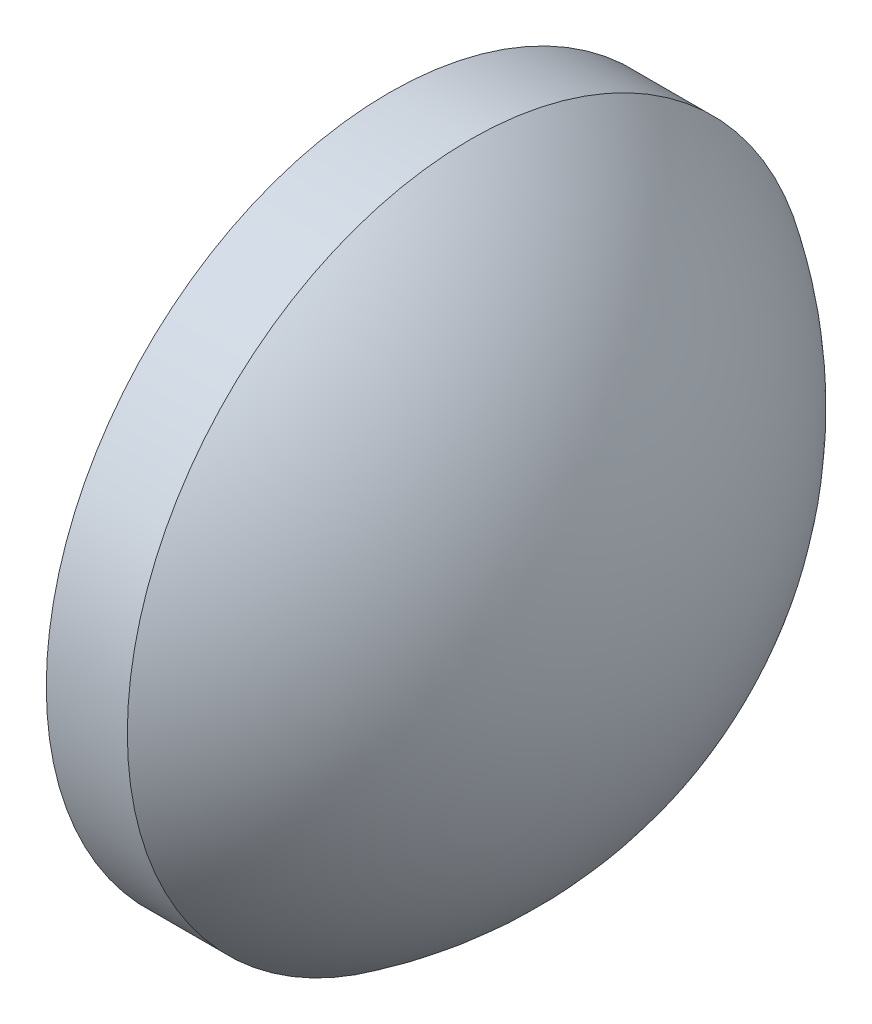
ISO-10303-21;
HEADER;
FILE_DESCRIPTION(('STEP AP214'),'2;1');
FILE_NAME('part.step','',(''),(''),'','','');
FILE_SCHEMA(('AUTOMOTIVE_DESIGN { 1 0 10303 214 1 1 1 1 }'));
ENDSEC;
DATA;
#1=APPLICATION_CONTEXT('core data for automotive mechanical design processes');
#2=APPLICATION_PROTOCOL_DEFINITION('international standard','automotive_design',2000,#1);
#3=PRODUCT_CONTEXT('',#1,'mechanical');
#4=PRODUCT('Part','Part','',(#3));
#5=PRODUCT_RELATED_PRODUCT_CATEGORY('part','',(#4));
#6=PRODUCT_DEFINITION_FORMATION('','',#4);
#7=PRODUCT_DEFINITION_CONTEXT('part definition',#1,'design');
#8=PRODUCT_DEFINITION('design','',#6,#7);
#9=PRODUCT_DEFINITION_SHAPE('','',#8);
#10=(LENGTH_UNIT() NAMED_UNIT(*) SI_UNIT(.MILLI.,.METRE.));
#11=(NAMED_UNIT(*) PLANE_ANGLE_UNIT() SI_UNIT($,.RADIAN.));
#12=(NAMED_UNIT(*) SI_UNIT($,.STERADIAN.) SOLID_ANGLE_UNIT());
#13=UNCERTAINTY_MEASURE_WITH_UNIT(LENGTH_MEASURE(1.E-05),#10,'distance_accuracy_value','');
#14=(GEOMETRIC_REPRESENTATION_CONTEXT(3) GLOBAL_UNCERTAINTY_ASSIGNED_CONTEXT((#13)) GLOBAL_UNIT_ASSIGNED_CONTEXT((#10,
#11,#12)) REPRESENTATION_CONTEXT('',''));
#15=CARTESIAN_POINT('',(0.,0.,0.));
#16=DIRECTION('',(0.,0.,1.));
#17=DIRECTION('',(1.,0.,0.));
#18=AXIS2_PLACEMENT_3D('',#15,#16,#17);
#19=CARTESIAN_POINT('',(110.555606430838,65.2335549264122,0.));
#20=DIRECTION('',(-1.,0.,0.));
#21=DIRECTION('',(0.,1.,0.));
#22=AXIS2_PLACEMENT_3D('',#19,#20,#21);
#23=SPHERICAL_SURFACE('',#22,15.128);
#24=CARTESIAN_POINT('',(118.775483802186,65.2335549264122,0.));
#25=DIRECTION('',(-1.,0.,0.));
#26=DIRECTION('',(0.,0.,1.));
#27=AXIS2_PLACEMENT_3D('',#24,#25,#26);
#28=CIRCLE('',#27,12.7);
#29=CARTESIAN_POINT('',(118.775483802186,65.2335549264122,12.7));
#30=VERTEX_POINT('',#29);
#31=EDGE_CURVE('E10',#30,#30,#28,.T.);
#32=ORIENTED_EDGE('',*,*,#31,.F.);
#33=EDGE_LOOP('',(#32));
#34=FACE_BOUND('',#33,.T.);
#35=ADVANCED_FACE('F35',(#34),#23,.T.);
#36=CARTESIAN_POINT('',(110.165373228488,65.2335549264122,0.));
#37=DIRECTION('',(-1.,0.,0.));
#38=DIRECTION('',(0.,0.,1.));
#39=AXIS2_PLACEMENT_3D('',#36,#37,#38);
#40=CYLINDRICAL_SURFACE('',#39,12.7);
#41=CARTESIAN_POINT('',(115.773606430838,65.2335549264122,0.));
#42=DIRECTION('',(-1.,0.,0.));
#43=DIRECTION('',(0.,0.,1.));
#44=AXIS2_PLACEMENT_3D('',#41,#42,#43);
#45=CIRCLE('',#44,12.7);
#46=CARTESIAN_POINT('',(115.773606430838,65.2335549264122,12.7));
#47=VERTEX_POINT('',#46);
#48=EDGE_CURVE('E41',#47,#47,#45,.T.);
#49=ORIENTED_EDGE('',*,*,#48,.F.);
#50=EDGE_LOOP('',(#49));
#51=FACE_BOUND('',#50,.T.);
#52=ORIENTED_EDGE('',*,*,#31,.T.);
#53=EDGE_LOOP('',(#52));
#54=FACE_BOUND('',#53,.T.);
#55=ADVANCED_FACE('F49',(#51,#54),#40,.T.);
#56=CARTESIAN_POINT('',(115.773606430838,65.2335549264122,0.));
#57=DIRECTION('',(1.,0.,0.));
#58=DIRECTION('',(0.,0.,-1.));
#59=AXIS2_PLACEMENT_3D('',#56,#57,#58);
#60=PLANE('',#59);
#61=ORIENTED_EDGE('',*,*,#48,.T.);
#62=EDGE_LOOP('',(#61));
#63=FACE_BOUND('',#62,.T.);
#64=ADVANCED_FACE('F47',(#63),#60,.F.);
#65=CLOSED_SHELL('',(#35,#55,#64));
#66=MANIFOLD_SOLID_BREP('B2',#65);
#67=ADVANCED_BREP_SHAPE_REPRESENTATION('',(#18,#66),#14);
#68=SHAPE_DEFINITION_REPRESENTATION(#9,#67);
ENDSEC;
END-ISO-10303-21;
